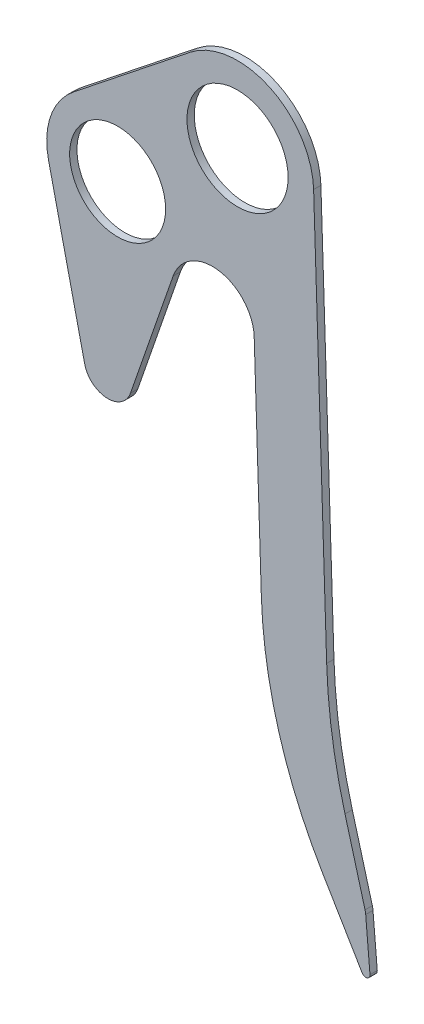
ISO-10303-21;
HEADER;
FILE_DESCRIPTION(('STEP AP214'),'2;1');
FILE_NAME('part.step','',(''),(''),'','','');
FILE_SCHEMA(('AUTOMOTIVE_DESIGN { 1 0 10303 214 1 1 1 1 }'));
ENDSEC;
DATA;
#1=APPLICATION_CONTEXT('core data for automotive mechanical design processes');
#2=APPLICATION_PROTOCOL_DEFINITION('international standard','automotive_design',2000,#1);
#3=PRODUCT_CONTEXT('',#1,'mechanical');
#4=PRODUCT('Part','Part','',(#3));
#5=PRODUCT_RELATED_PRODUCT_CATEGORY('part','',(#4));
#6=PRODUCT_DEFINITION_FORMATION('','',#4);
#7=PRODUCT_DEFINITION_CONTEXT('part definition',#1,'design');
#8=PRODUCT_DEFINITION('design','',#6,#7);
#9=PRODUCT_DEFINITION_SHAPE('','',#8);
#10=(LENGTH_UNIT() NAMED_UNIT(*) SI_UNIT(.MILLI.,.METRE.));
#11=(NAMED_UNIT(*) PLANE_ANGLE_UNIT() SI_UNIT($,.RADIAN.));
#12=(NAMED_UNIT(*) SI_UNIT($,.STERADIAN.) SOLID_ANGLE_UNIT());
#13=UNCERTAINTY_MEASURE_WITH_UNIT(LENGTH_MEASURE(1.E-05),#10,'distance_accuracy_value','');
#14=(GEOMETRIC_REPRESENTATION_CONTEXT(3) GLOBAL_UNCERTAINTY_ASSIGNED_CONTEXT((#13)) GLOBAL_UNIT_ASSIGNED_CONTEXT((#10,
#11,#12)) REPRESENTATION_CONTEXT('',''));
#15=CARTESIAN_POINT('',(0.,0.,0.));
#16=DIRECTION('',(0.,0.,1.));
#17=DIRECTION('',(1.,0.,0.));
#18=AXIS2_PLACEMENT_3D('',#15,#16,#17);
#19=CARTESIAN_POINT('',(-115.,-85.,7.));
#20=DIRECTION('',(0.,0.,1.));
#21=DIRECTION('',(1.,0.,0.));
#22=AXIS2_PLACEMENT_3D('',#19,#20,#21);
#23=PLANE('',#22);
#24=CARTESIAN_POINT('',(0.,0.,7.));
#25=DIRECTION('',(0.,0.,1.));
#26=DIRECTION('',(1.,0.,0.));
#27=AXIS2_PLACEMENT_3D('',#24,#25,#26);
#28=CIRCLE('',#27,48.5);
#29=CARTESIAN_POINT('',(48.5,0.,7.));
#30=VERTEX_POINT('',#29);
#31=EDGE_CURVE('E188',#30,#30,#28,.T.);
#32=ORIENTED_EDGE('',*,*,#31,.F.);
#33=EDGE_LOOP('',(#32));
#34=FACE_BOUND('',#33,.T.);
#35=CARTESIAN_POINT('',(-115.,-85.,7.));
#36=DIRECTION('',(0.,0.,1.));
#37=DIRECTION('',(1.,0.,0.));
#38=AXIS2_PLACEMENT_3D('',#35,#36,#37);
#39=CIRCLE('',#38,68.);
#40=CARTESIAN_POINT('',(-157.305859297598,-31.7626609503083,7.));
#41=VERTEX_POINT('',#40);
#42=CARTESIAN_POINT('',(-181.296983892909,-100.123158621906,7.));
#43=VERTEX_POINT('',#42);
#44=EDGE_CURVE('E215',#41,#43,#39,.T.);
#45=ORIENTED_EDGE('',*,*,#44,.T.);
#46=DIRECTION('',(0.222399391498616,-0.97495564548396,0.));
#47=VECTOR('',#46,1.);
#48=CARTESIAN_POINT('',(-181.296983892909,-100.123158621906,7.));
#49=LINE('',#48,#47);
#50=CARTESIAN_POINT('',(-146.605418010177,-252.204231236977,7.));
#51=VERTEX_POINT('',#50);
#52=EDGE_CURVE('E123',#43,#51,#49,.T.);
#53=ORIENTED_EDGE('',*,*,#52,.T.);
#54=CARTESIAN_POINT('',(-124.293083076856,-247.114512812278,7.));
#55=DIRECTION('',(0.,0.,1.));
#56=DIRECTION('',(1.,0.,0.));
#57=AXIS2_PLACEMENT_3D('',#54,#55,#56);
#58=CIRCLE('',#57,22.8854871877222);
#59=CARTESIAN_POINT('',(-102.674010073079,-254.62192290343,7.));
#60=VERTEX_POINT('',#59);
#61=EDGE_CURVE('E254',#51,#60,#58,.T.);
#62=ORIENTED_EDGE('',*,*,#61,.T.);
#63=DIRECTION('',(0.328042397768122,0.94466300089849,0.));
#64=VECTOR('',#63,1.);
#65=CARTESIAN_POINT('',(-61.7865200359396,-136.878304089275,7.));
#66=LINE('',#65,#64);
#67=CARTESIAN_POINT('',(-61.7865200359396,-136.878304089275,7.));
#68=VERTEX_POINT('',#67);
#69=EDGE_CURVE('E273',#60,#68,#66,.T.);
#70=ORIENTED_EDGE('',*,*,#69,.T.);
#71=CARTESIAN_POINT('',(-24.,-150.,7.));
#72=DIRECTION('',(0.,0.,-1.));
#73=DIRECTION('',(1.,0.,0.));
#74=AXIS2_PLACEMENT_3D('',#71,#72,#73);
#75=CIRCLE('',#74,40.);
#76=CARTESIAN_POINT('',(15.979150749081,-148.708680758969,7.));
#77=VERTEX_POINT('',#76);
#78=EDGE_CURVE('E270',#68,#77,#75,.T.);
#79=ORIENTED_EDGE('',*,*,#78,.T.);
#80=DIRECTION('',(0.0322829810257712,-0.999478768727025,0.));
#81=VECTOR('',#80,1.);
#82=CARTESIAN_POINT('',(15.979150749081,-148.708680758969,7.));
#83=LINE('',#82,#81);
#84=CARTESIAN_POINT('',(22.8038216309407,-360.,7.));
#85=VERTEX_POINT('',#84);
#86=EDGE_CURVE('E272',#77,#85,#83,.T.);
#87=ORIENTED_EDGE('',*,*,#86,.T.);
#88=CARTESIAN_POINT('',(442.584904496291,-346.441147969176,7.));
#89=DIRECTION('',(0.,0.,1.));
#90=DIRECTION('',(1.,0.,0.));
#91=AXIS2_PLACEMENT_3D('',#88,#89,#90);
#92=CIRCLE('',#91,420.);
#93=CARTESIAN_POINT('',(81.4729059463614,-560.912881545598,7.));
#94=VERTEX_POINT('',#93);
#95=EDGE_CURVE('E275',#85,#94,#92,.T.);
#96=ORIENTED_EDGE('',*,*,#95,.T.);
#97=DIRECTION('',(0.510646984705767,-0.859790472737927,0.));
#98=VECTOR('',#97,1.);
#99=CARTESIAN_POINT('',(81.4729059463614,-560.912881545598,7.));
#100=LINE('',#99,#98);
#101=CARTESIAN_POINT('',(119.560838109048,-625.042587938823,7.));
#102=VERTEX_POINT('',#101);
#103=EDGE_CURVE('E281',#94,#102,#100,.T.);
#104=ORIENTED_EDGE('',*,*,#103,.T.);
#105=CARTESIAN_POINT('',(123.,-623.,7.));
#106=DIRECTION('',(0.,0.,1.));
#107=DIRECTION('',(1.,0.,0.));
#108=AXIS2_PLACEMENT_3D('',#105,#106,#107);
#109=CIRCLE('',#108,4.);
#110=CARTESIAN_POINT('',(126.985562324961,-622.660451838684,7.));
#111=VERTEX_POINT('',#110);
#112=EDGE_CURVE('E283',#102,#111,#109,.T.);
#113=ORIENTED_EDGE('',*,*,#112,.T.);
#114=DIRECTION('',(-0.0848870403290094,0.996390581240199,0.));
#115=VECTOR('',#114,1.);
#116=CARTESIAN_POINT('',(126.985562324961,-622.660451838684,7.));
#117=LINE('',#116,#115);
#118=CARTESIAN_POINT('',(122.910471508926,-574.827683832422,7.));
#119=VERTEX_POINT('',#118);
#120=EDGE_CURVE('E285',#111,#119,#117,.T.);
#121=ORIENTED_EDGE('',*,*,#120,.T.);
#122=CARTESIAN_POINT('',(102.982659884122,-576.525424639002,7.));
#123=DIRECTION('',(0.,0.,1.));
#124=DIRECTION('',(1.,0.,0.));
#125=AXIS2_PLACEMENT_3D('',#122,#123,#124);
#126=CIRCLE('',#125,19.9999999999999);
#127=CARTESIAN_POINT('',(122.269195454809,-571.231130948563,7.));
#128=VERTEX_POINT('',#127);
#129=EDGE_CURVE('E287',#119,#128,#126,.T.);
#130=ORIENTED_EDGE('',*,*,#129,.T.);
#131=DIRECTION('',(-0.264714684521961,0.964326778534351,0.));
#132=VECTOR('',#131,1.);
#133=CARTESIAN_POINT('',(122.269195454809,-571.231130948563,7.));
#134=LINE('',#133,#132);
#135=CARTESIAN_POINT('',(103.04949425203,-501.215851748095,7.));
#136=VERTEX_POINT('',#135);
#137=EDGE_CURVE('E289',#128,#136,#134,.T.);
#138=ORIENTED_EDGE('',*,*,#137,.T.);
#139=CARTESIAN_POINT('',(585.212883519205,-368.858509487114,7.));
#140=DIRECTION('',(0.,0.,-1.));
#141=DIRECTION('',(-1.,0.,0.));
#142=AXIS2_PLACEMENT_3D('',#139,#140,#141);
#143=CIRCLE('',#142,500.);
#144=CARTESIAN_POINT('',(85.4734991556925,-385.,7.));
#145=VERTEX_POINT('',#144);
#146=EDGE_CURVE('E166',#136,#145,#143,.T.);
#147=ORIENTED_EDGE('',*,*,#146,.T.);
#148=DIRECTION('',(-0.0322829810257712,0.999478768727025,0.));
#149=VECTOR('',#148,1.);
#150=CARTESIAN_POINT('',(72.9619501170728,2.3566576148813,7.));
#151=LINE('',#150,#149);
#152=CARTESIAN_POINT('',(72.9619501170728,2.3566576148813,7.));
#153=VERTEX_POINT('',#152);
#154=EDGE_CURVE('E160',#145,#153,#151,.T.);
#155=ORIENTED_EDGE('',*,*,#154,.T.);
#156=CARTESIAN_POINT('',(0.,0.,7.));
#157=DIRECTION('',(0.,0.,1.));
#158=DIRECTION('',(1.,0.,0.));
#159=AXIS2_PLACEMENT_3D('',#156,#157,#158);
#160=CIRCLE('',#159,73.);
#161=CARTESIAN_POINT('',(-45.416584245951,57.1518492739337,7.));
#162=VERTEX_POINT('',#161);
#163=EDGE_CURVE('E164',#153,#162,#160,.T.);
#164=ORIENTED_EDGE('',*,*,#163,.T.);
#165=DIRECTION('',(-0.782902044848407,-0.622144989670562,0.));
#166=VECTOR('',#165,1.);
#167=CARTESIAN_POINT('',(-45.416584245951,57.1518492739337,7.));
#168=LINE('',#167,#166);
#169=EDGE_CURVE('E56',#162,#41,#168,.T.);
#170=ORIENTED_EDGE('',*,*,#169,.T.);
#171=EDGE_LOOP('',(#45,#53,#62,#70,#79,#87,#96,#104,#113,#121,#130,#138,#147,#155,#164,#170));
#172=FACE_BOUND('',#171,.T.);
#173=CARTESIAN_POINT('',(-115.,-85.,7.));
#174=DIRECTION('',(0.,0.,1.));
#175=DIRECTION('',(1.,0.,0.));
#176=AXIS2_PLACEMENT_3D('',#173,#174,#175);
#177=CIRCLE('',#176,46.);
#178=CARTESIAN_POINT('',(-69.,-85.,7.));
#179=VERTEX_POINT('',#178);
#180=EDGE_CURVE('E332',#179,#179,#177,.T.);
#181=ORIENTED_EDGE('',*,*,#180,.F.);
#182=EDGE_LOOP('',(#181));
#183=FACE_BOUND('',#182,.T.);
#184=ADVANCED_FACE('F39',(#34,#172,#183),#23,.T.);
#185=CARTESIAN_POINT('',(-115.,-85.,0.));
#186=DIRECTION('',(0.,0.,1.));
#187=DIRECTION('',(1.,0.,0.));
#188=AXIS2_PLACEMENT_3D('',#185,#186,#187);
#189=PLANE('',#188);
#190=CARTESIAN_POINT('',(0.,0.,0.));
#191=DIRECTION('',(0.,0.,1.));
#192=DIRECTION('',(1.,0.,0.));
#193=AXIS2_PLACEMENT_3D('',#190,#191,#192);
#194=CIRCLE('',#193,48.5);
#195=CARTESIAN_POINT('',(48.5,0.,0.));
#196=VERTEX_POINT('',#195);
#197=EDGE_CURVE('E337',#196,#196,#194,.T.);
#198=ORIENTED_EDGE('',*,*,#197,.T.);
#199=EDGE_LOOP('',(#198));
#200=FACE_BOUND('',#199,.T.);
#201=CARTESIAN_POINT('',(-115.,-85.,0.));
#202=DIRECTION('',(0.,0.,1.));
#203=DIRECTION('',(1.,0.,0.));
#204=AXIS2_PLACEMENT_3D('',#201,#202,#203);
#205=CIRCLE('',#204,68.);
#206=CARTESIAN_POINT('',(-157.305859297598,-31.7626609503083,0.));
#207=VERTEX_POINT('',#206);
#208=CARTESIAN_POINT('',(-181.296983892909,-100.123158621906,0.));
#209=VERTEX_POINT('',#208);
#210=EDGE_CURVE('E184',#207,#209,#205,.T.);
#211=ORIENTED_EDGE('',*,*,#210,.F.);
#212=DIRECTION('',(-0.782902044848407,-0.622144989670562,0.));
#213=VECTOR('',#212,1.);
#214=CARTESIAN_POINT('',(-45.416584245951,57.1518492739337,0.));
#215=LINE('',#214,#213);
#216=CARTESIAN_POINT('',(-45.416584245951,57.1518492739337,0.));
#217=VERTEX_POINT('',#216);
#218=EDGE_CURVE('E115',#217,#207,#215,.T.);
#219=ORIENTED_EDGE('',*,*,#218,.F.);
#220=CARTESIAN_POINT('',(0.,0.,0.));
#221=DIRECTION('',(0.,0.,1.));
#222=DIRECTION('',(1.,0.,0.));
#223=AXIS2_PLACEMENT_3D('',#220,#221,#222);
#224=CIRCLE('',#223,73.);
#225=CARTESIAN_POINT('',(72.9619501170728,2.3566576148813,0.));
#226=VERTEX_POINT('',#225);
#227=EDGE_CURVE('E109',#226,#217,#224,.T.);
#228=ORIENTED_EDGE('',*,*,#227,.F.);
#229=DIRECTION('',(-0.0322829810257712,0.999478768727025,0.));
#230=VECTOR('',#229,1.);
#231=CARTESIAN_POINT('',(72.9619501170728,2.3566576148813,0.));
#232=LINE('',#231,#230);
#233=CARTESIAN_POINT('',(85.4734991556925,-385.,0.));
#234=VERTEX_POINT('',#233);
#235=EDGE_CURVE('E174',#234,#226,#232,.T.);
#236=ORIENTED_EDGE('',*,*,#235,.F.);
#237=CARTESIAN_POINT('',(585.212883519205,-368.858509487114,0.));
#238=DIRECTION('',(0.,0.,-1.));
#239=DIRECTION('',(-1.,0.,0.));
#240=AXIS2_PLACEMENT_3D('',#237,#238,#239);
#241=CIRCLE('',#240,500.);
#242=CARTESIAN_POINT('',(103.04949425203,-501.215851748095,0.));
#243=VERTEX_POINT('',#242);
#244=EDGE_CURVE('E210',#243,#234,#241,.T.);
#245=ORIENTED_EDGE('',*,*,#244,.F.);
#246=DIRECTION('',(-0.264714684521961,0.964326778534351,0.));
#247=VECTOR('',#246,1.);
#248=CARTESIAN_POINT('',(122.269195454809,-571.231130948563,0.));
#249=LINE('',#248,#247);
#250=CARTESIAN_POINT('',(122.269195454809,-571.231130948563,0.));
#251=VERTEX_POINT('',#250);
#252=EDGE_CURVE('E208',#251,#243,#249,.T.);
#253=ORIENTED_EDGE('',*,*,#252,.F.);
#254=CARTESIAN_POINT('',(102.982659884122,-576.525424639002,0.));
#255=DIRECTION('',(0.,0.,1.));
#256=DIRECTION('',(1.,0.,0.));
#257=AXIS2_PLACEMENT_3D('',#254,#255,#256);
#258=CIRCLE('',#257,19.9999999999999);
#259=CARTESIAN_POINT('',(122.910471508926,-574.827683832422,0.));
#260=VERTEX_POINT('',#259);
#261=EDGE_CURVE('E206',#260,#251,#258,.T.);
#262=ORIENTED_EDGE('',*,*,#261,.F.);
#263=DIRECTION('',(-0.0848870403290094,0.996390581240199,0.));
#264=VECTOR('',#263,1.);
#265=CARTESIAN_POINT('',(126.985562324961,-622.660451838684,0.));
#266=LINE('',#265,#264);
#267=CARTESIAN_POINT('',(126.985562324961,-622.660451838684,0.));
#268=VERTEX_POINT('',#267);
#269=EDGE_CURVE('E204',#268,#260,#266,.T.);
#270=ORIENTED_EDGE('',*,*,#269,.F.);
#271=CARTESIAN_POINT('',(123.,-623.,0.));
#272=DIRECTION('',(0.,0.,1.));
#273=DIRECTION('',(1.,0.,0.));
#274=AXIS2_PLACEMENT_3D('',#271,#272,#273);
#275=CIRCLE('',#274,4.);
#276=CARTESIAN_POINT('',(119.560838109048,-625.042587938823,0.));
#277=VERTEX_POINT('',#276);
#278=EDGE_CURVE('E202',#277,#268,#275,.T.);
#279=ORIENTED_EDGE('',*,*,#278,.F.);
#280=DIRECTION('',(0.510646984705767,-0.859790472737927,0.));
#281=VECTOR('',#280,1.);
#282=CARTESIAN_POINT('',(81.4729059463614,-560.912881545598,0.));
#283=LINE('',#282,#281);
#284=CARTESIAN_POINT('',(81.4729059463614,-560.912881545598,0.));
#285=VERTEX_POINT('',#284);
#286=EDGE_CURVE('E200',#285,#277,#283,.T.);
#287=ORIENTED_EDGE('',*,*,#286,.F.);
#288=CARTESIAN_POINT('',(442.584904496291,-346.441147969176,0.));
#289=DIRECTION('',(0.,0.,1.));
#290=DIRECTION('',(1.,0.,0.));
#291=AXIS2_PLACEMENT_3D('',#288,#289,#290);
#292=CIRCLE('',#291,420.);
#293=CARTESIAN_POINT('',(22.8038216309407,-360.,0.));
#294=VERTEX_POINT('',#293);
#295=EDGE_CURVE('E198',#294,#285,#292,.T.);
#296=ORIENTED_EDGE('',*,*,#295,.F.);
#297=DIRECTION('',(0.0322829810257712,-0.999478768727025,0.));
#298=VECTOR('',#297,1.);
#299=CARTESIAN_POINT('',(15.979150749081,-148.708680758969,0.));
#300=LINE('',#299,#298);
#301=CARTESIAN_POINT('',(15.979150749081,-148.708680758969,0.));
#302=VERTEX_POINT('',#301);
#303=EDGE_CURVE('E196',#302,#294,#300,.T.);
#304=ORIENTED_EDGE('',*,*,#303,.F.);
#305=CARTESIAN_POINT('',(-24.,-150.,0.));
#306=DIRECTION('',(0.,0.,-1.));
#307=DIRECTION('',(1.,0.,0.));
#308=AXIS2_PLACEMENT_3D('',#305,#306,#307);
#309=CIRCLE('',#308,40.);
#310=CARTESIAN_POINT('',(-61.7865200359396,-136.878304089275,0.));
#311=VERTEX_POINT('',#310);
#312=EDGE_CURVE('E194',#311,#302,#309,.T.);
#313=ORIENTED_EDGE('',*,*,#312,.F.);
#314=DIRECTION('',(0.328042397768122,0.94466300089849,0.));
#315=VECTOR('',#314,1.);
#316=CARTESIAN_POINT('',(-61.7865200359396,-136.878304089275,0.));
#317=LINE('',#316,#315);
#318=CARTESIAN_POINT('',(-102.674010073079,-254.62192290343,0.));
#319=VERTEX_POINT('',#318);
#320=EDGE_CURVE('E192',#319,#311,#317,.T.);
#321=ORIENTED_EDGE('',*,*,#320,.F.);
#322=CARTESIAN_POINT('',(-124.293083076856,-247.114512812278,0.));
#323=DIRECTION('',(0.,0.,1.));
#324=DIRECTION('',(1.,0.,0.));
#325=AXIS2_PLACEMENT_3D('',#322,#323,#324);
#326=CIRCLE('',#325,22.8854871877222);
#327=CARTESIAN_POINT('',(-146.605418010177,-252.204231236977,0.));
#328=VERTEX_POINT('',#327);
#329=EDGE_CURVE('E190',#328,#319,#326,.T.);
#330=ORIENTED_EDGE('',*,*,#329,.F.);
#331=DIRECTION('',(0.222399391498616,-0.97495564548396,0.));
#332=VECTOR('',#331,1.);
#333=CARTESIAN_POINT('',(-181.296983892909,-100.123158621906,0.));
#334=LINE('',#333,#332);
#335=EDGE_CURVE('E187',#209,#328,#334,.T.);
#336=ORIENTED_EDGE('',*,*,#335,.F.);
#337=EDGE_LOOP('',(#211,#219,#228,#236,#245,#253,#262,#270,#279,#287,#296,#304,#313,#321,#330,#336));
#338=FACE_BOUND('',#337,.T.);
#339=CARTESIAN_POINT('',(-115.,-85.,0.));
#340=DIRECTION('',(0.,0.,1.));
#341=DIRECTION('',(1.,0.,0.));
#342=AXIS2_PLACEMENT_3D('',#339,#340,#341);
#343=CIRCLE('',#342,46.);
#344=CARTESIAN_POINT('',(-69.,-85.,0.));
#345=VERTEX_POINT('',#344);
#346=EDGE_CURVE('E335',#345,#345,#343,.T.);
#347=ORIENTED_EDGE('',*,*,#346,.T.);
#348=EDGE_LOOP('',(#347));
#349=FACE_BOUND('',#348,.T.);
#350=ADVANCED_FACE('F258',(#200,#338,#349),#189,.F.);
#351=CARTESIAN_POINT('',(-115.,-85.,7.));
#352=DIRECTION('',(0.,0.,-1.));
#353=DIRECTION('',(-1.,0.,0.));
#354=AXIS2_PLACEMENT_3D('',#351,#352,#353);
#355=CYLINDRICAL_SURFACE('',#354,68.);
#356=ORIENTED_EDGE('',*,*,#210,.T.);
#357=DIRECTION('',(0.,0.,-1.));
#358=VECTOR('',#357,1.);
#359=CARTESIAN_POINT('',(-181.296983892909,-100.123158621906,7.));
#360=LINE('',#359,#358);
#361=EDGE_CURVE('E11',#43,#209,#360,.T.);
#362=ORIENTED_EDGE('',*,*,#361,.F.);
#363=ORIENTED_EDGE('',*,*,#44,.F.);
#364=DIRECTION('',(0.,0.,-1.));
#365=VECTOR('',#364,1.);
#366=CARTESIAN_POINT('',(-157.305859297598,-31.7626609503083,7.));
#367=LINE('',#366,#365);
#368=EDGE_CURVE('E180',#41,#207,#367,.T.);
#369=ORIENTED_EDGE('',*,*,#368,.T.);
#370=EDGE_LOOP('',(#356,#362,#363,#369));
#371=FACE_BOUND('',#370,.T.);
#372=ADVANCED_FACE('F41',(#371),#355,.T.);
#373=CARTESIAN_POINT('',(-181.296983892909,-100.123158621906,7.));
#374=DIRECTION('',(0.97495564548396,0.222399391498616,0.));
#375=DIRECTION('',(-0.222399391498616,0.97495564548396,0.));
#376=AXIS2_PLACEMENT_3D('',#373,#374,#375);
#377=PLANE('',#376);
#378=ORIENTED_EDGE('',*,*,#335,.T.);
#379=DIRECTION('',(0.,0.,-1.));
#380=VECTOR('',#379,1.);
#381=CARTESIAN_POINT('',(-146.605418010177,-252.204231236977,7.));
#382=LINE('',#381,#380);
#383=EDGE_CURVE('E48',#51,#328,#382,.T.);
#384=ORIENTED_EDGE('',*,*,#383,.F.);
#385=ORIENTED_EDGE('',*,*,#52,.F.);
#386=ORIENTED_EDGE('',*,*,#361,.T.);
#387=EDGE_LOOP('',(#378,#384,#385,#386));
#388=FACE_BOUND('',#387,.T.);
#389=ADVANCED_FACE('F442',(#388),#377,.F.);
#390=CARTESIAN_POINT('',(-124.293083076856,-247.114512812278,7.));
#391=DIRECTION('',(0.,0.,-1.));
#392=DIRECTION('',(-1.,0.,0.));
#393=AXIS2_PLACEMENT_3D('',#390,#391,#392);
#394=CYLINDRICAL_SURFACE('',#393,22.8854871877222);
#395=ORIENTED_EDGE('',*,*,#329,.T.);
#396=DIRECTION('',(0.,0.,-1.));
#397=VECTOR('',#396,1.);
#398=CARTESIAN_POINT('',(-102.674010073079,-254.62192290343,7.));
#399=LINE('',#398,#397);
#400=EDGE_CURVE('E246',#60,#319,#399,.T.);
#401=ORIENTED_EDGE('',*,*,#400,.F.);
#402=ORIENTED_EDGE('',*,*,#61,.F.);
#403=ORIENTED_EDGE('',*,*,#383,.T.);
#404=EDGE_LOOP('',(#395,#401,#402,#403));
#405=FACE_BOUND('',#404,.T.);
#406=ADVANCED_FACE('F252',(#405),#394,.T.);
#407=CARTESIAN_POINT('',(-61.7865200359396,-136.878304089275,7.));
#408=DIRECTION('',(-0.94466300089849,0.328042397768122,0.));
#409=DIRECTION('',(-0.328042397768122,-0.94466300089849,0.));
#410=AXIS2_PLACEMENT_3D('',#407,#408,#409);
#411=PLANE('',#410);
#412=ORIENTED_EDGE('',*,*,#320,.T.);
#413=DIRECTION('',(0.,0.,-1.));
#414=VECTOR('',#413,1.);
#415=CARTESIAN_POINT('',(-61.7865200359396,-136.878304089275,7.));
#416=LINE('',#415,#414);
#417=EDGE_CURVE('E243',#68,#311,#416,.T.);
#418=ORIENTED_EDGE('',*,*,#417,.F.);
#419=ORIENTED_EDGE('',*,*,#69,.F.);
#420=ORIENTED_EDGE('',*,*,#400,.T.);
#421=EDGE_LOOP('',(#412,#418,#419,#420));
#422=FACE_BOUND('',#421,.T.);
#423=ADVANCED_FACE('F264',(#422),#411,.F.);
#424=CARTESIAN_POINT('',(-24.,-150.,7.));
#425=DIRECTION('',(0.,0.,-1.));
#426=DIRECTION('',(-1.,0.,0.));
#427=AXIS2_PLACEMENT_3D('',#424,#425,#426);
#428=CYLINDRICAL_SURFACE('',#427,40.);
#429=ORIENTED_EDGE('',*,*,#312,.T.);
#430=DIRECTION('',(0.,0.,-1.));
#431=VECTOR('',#430,1.);
#432=CARTESIAN_POINT('',(15.979150749081,-148.708680758969,7.));
#433=LINE('',#432,#431);
#434=EDGE_CURVE('E240',#77,#302,#433,.T.);
#435=ORIENTED_EDGE('',*,*,#434,.F.);
#436=ORIENTED_EDGE('',*,*,#78,.F.);
#437=ORIENTED_EDGE('',*,*,#417,.T.);
#438=EDGE_LOOP('',(#429,#435,#436,#437));
#439=FACE_BOUND('',#438,.T.);
#440=ADVANCED_FACE('F268',(#439),#428,.F.);
#441=CARTESIAN_POINT('',(15.979150749081,-148.708680758969,7.));
#442=DIRECTION('',(0.999478768727025,0.0322829810257712,0.));
#443=DIRECTION('',(-0.0322829810257712,0.999478768727025,0.));
#444=AXIS2_PLACEMENT_3D('',#441,#442,#443);
#445=PLANE('',#444);
#446=ORIENTED_EDGE('',*,*,#303,.T.);
#447=DIRECTION('',(0.,0.,-1.));
#448=VECTOR('',#447,1.);
#449=CARTESIAN_POINT('',(22.8038216309407,-360.,7.));
#450=LINE('',#449,#448);
#451=EDGE_CURVE('E237',#85,#294,#450,.T.);
#452=ORIENTED_EDGE('',*,*,#451,.F.);
#453=ORIENTED_EDGE('',*,*,#86,.F.);
#454=ORIENTED_EDGE('',*,*,#434,.T.);
#455=EDGE_LOOP('',(#446,#452,#453,#454));
#456=FACE_BOUND('',#455,.T.);
#457=ADVANCED_FACE('F415',(#456),#445,.F.);
#458=CARTESIAN_POINT('',(442.584904496291,-346.441147969176,7.));
#459=DIRECTION('',(0.,0.,-1.));
#460=DIRECTION('',(-1.,0.,0.));
#461=AXIS2_PLACEMENT_3D('',#458,#459,#460);
#462=CYLINDRICAL_SURFACE('',#461,420.);
#463=ORIENTED_EDGE('',*,*,#295,.T.);
#464=DIRECTION('',(0.,0.,-1.));
#465=VECTOR('',#464,1.);
#466=CARTESIAN_POINT('',(81.4729059463614,-560.912881545598,7.));
#467=LINE('',#466,#465);
#468=EDGE_CURVE('E234',#94,#285,#467,.T.);
#469=ORIENTED_EDGE('',*,*,#468,.F.);
#470=ORIENTED_EDGE('',*,*,#95,.F.);
#471=ORIENTED_EDGE('',*,*,#451,.T.);
#472=EDGE_LOOP('',(#463,#469,#470,#471));
#473=FACE_BOUND('',#472,.T.);
#474=ADVANCED_FACE('F407',(#473),#462,.T.);
#475=CARTESIAN_POINT('',(81.4729059463614,-560.912881545598,7.));
#476=DIRECTION('',(0.859790472737927,0.510646984705766,0.));
#477=DIRECTION('',(-0.510646984705767,0.859790472737928,0.));
#478=AXIS2_PLACEMENT_3D('',#475,#476,#477);
#479=PLANE('',#478);
#480=ORIENTED_EDGE('',*,*,#286,.T.);
#481=DIRECTION('',(0.,0.,-1.));
#482=VECTOR('',#481,1.);
#483=CARTESIAN_POINT('',(119.560838109048,-625.042587938823,7.));
#484=LINE('',#483,#482);
#485=EDGE_CURVE('E231',#102,#277,#484,.T.);
#486=ORIENTED_EDGE('',*,*,#485,.F.);
#487=ORIENTED_EDGE('',*,*,#103,.F.);
#488=ORIENTED_EDGE('',*,*,#468,.T.);
#489=EDGE_LOOP('',(#480,#486,#487,#488));
#490=FACE_BOUND('',#489,.T.);
#491=ADVANCED_FACE('F399',(#490),#479,.F.);
#492=CARTESIAN_POINT('',(123.,-623.,7.));
#493=DIRECTION('',(0.,0.,-1.));
#494=DIRECTION('',(-1.,0.,0.));
#495=AXIS2_PLACEMENT_3D('',#492,#493,#494);
#496=CYLINDRICAL_SURFACE('',#495,4.);
#497=ORIENTED_EDGE('',*,*,#278,.T.);
#498=DIRECTION('',(0.,0.,-1.));
#499=VECTOR('',#498,1.);
#500=CARTESIAN_POINT('',(126.985562324961,-622.660451838684,7.));
#501=LINE('',#500,#499);
#502=EDGE_CURVE('E228',#111,#268,#501,.T.);
#503=ORIENTED_EDGE('',*,*,#502,.F.);
#504=ORIENTED_EDGE('',*,*,#112,.F.);
#505=ORIENTED_EDGE('',*,*,#485,.T.);
#506=EDGE_LOOP('',(#497,#503,#504,#505));
#507=FACE_BOUND('',#506,.T.);
#508=ADVANCED_FACE('F391',(#507),#496,.T.);
#509=CARTESIAN_POINT('',(126.985562324961,-622.660451838684,7.));
#510=DIRECTION('',(-0.996390581240199,-0.0848870403290094,0.));
#511=DIRECTION('',(0.0848870403290094,-0.996390581240199,0.));
#512=AXIS2_PLACEMENT_3D('',#509,#510,#511);
#513=PLANE('',#512);
#514=ORIENTED_EDGE('',*,*,#269,.T.);
#515=DIRECTION('',(0.,0.,-1.));
#516=VECTOR('',#515,1.);
#517=CARTESIAN_POINT('',(122.910471508926,-574.827683832422,7.));
#518=LINE('',#517,#516);
#519=EDGE_CURVE('E225',#119,#260,#518,.T.);
#520=ORIENTED_EDGE('',*,*,#519,.F.);
#521=ORIENTED_EDGE('',*,*,#120,.F.);
#522=ORIENTED_EDGE('',*,*,#502,.T.);
#523=EDGE_LOOP('',(#514,#520,#521,#522));
#524=FACE_BOUND('',#523,.T.);
#525=ADVANCED_FACE('F383',(#524),#513,.F.);
#526=CARTESIAN_POINT('',(102.982659884122,-576.525424639002,7.));
#527=DIRECTION('',(0.,0.,-1.));
#528=DIRECTION('',(-1.,0.,0.));
#529=AXIS2_PLACEMENT_3D('',#526,#527,#528);
#530=CYLINDRICAL_SURFACE('',#529,19.9999999999999);
#531=ORIENTED_EDGE('',*,*,#261,.T.);
#532=DIRECTION('',(0.,0.,-1.));
#533=VECTOR('',#532,1.);
#534=CARTESIAN_POINT('',(122.269195454809,-571.231130948563,7.));
#535=LINE('',#534,#533);
#536=EDGE_CURVE('E222',#128,#251,#535,.T.);
#537=ORIENTED_EDGE('',*,*,#536,.F.);
#538=ORIENTED_EDGE('',*,*,#129,.F.);
#539=ORIENTED_EDGE('',*,*,#519,.T.);
#540=EDGE_LOOP('',(#531,#537,#538,#539));
#541=FACE_BOUND('',#540,.T.);
#542=ADVANCED_FACE('F376',(#541),#530,.T.);
#543=CARTESIAN_POINT('',(122.269195454809,-571.231130948563,7.));
#544=DIRECTION('',(-0.964326778534351,-0.264714684521961,0.));
#545=DIRECTION('',(0.264714684521961,-0.964326778534351,0.));
#546=AXIS2_PLACEMENT_3D('',#543,#544,#545);
#547=PLANE('',#546);
#548=ORIENTED_EDGE('',*,*,#252,.T.);
#549=DIRECTION('',(0.,0.,-1.));
#550=VECTOR('',#549,1.);
#551=CARTESIAN_POINT('',(103.04949425203,-501.215851748095,7.));
#552=LINE('',#551,#550);
#553=EDGE_CURVE('E219',#136,#243,#552,.T.);
#554=ORIENTED_EDGE('',*,*,#553,.F.);
#555=ORIENTED_EDGE('',*,*,#137,.F.);
#556=ORIENTED_EDGE('',*,*,#536,.T.);
#557=EDGE_LOOP('',(#548,#554,#555,#556));
#558=FACE_BOUND('',#557,.T.);
#559=ADVANCED_FACE('F295',(#558),#547,.F.);
#560=CARTESIAN_POINT('',(585.212883519205,-368.858509487114,7.));
#561=DIRECTION('',(0.,0.,-1.));
#562=DIRECTION('',(-1.,0.,0.));
#563=AXIS2_PLACEMENT_3D('',#560,#561,#562);
#564=CYLINDRICAL_SURFACE('',#563,500.);
#565=ORIENTED_EDGE('',*,*,#244,.T.);
#566=DIRECTION('',(0.,0.,-1.));
#567=VECTOR('',#566,1.);
#568=CARTESIAN_POINT('',(85.4734991556925,-385.,7.));
#569=LINE('',#568,#567);
#570=EDGE_CURVE('E175',#145,#234,#569,.T.);
#571=ORIENTED_EDGE('',*,*,#570,.F.);
#572=ORIENTED_EDGE('',*,*,#146,.F.);
#573=ORIENTED_EDGE('',*,*,#553,.T.);
#574=EDGE_LOOP('',(#565,#571,#572,#573));
#575=FACE_BOUND('',#574,.T.);
#576=ADVANCED_FACE('F299',(#575),#564,.F.);
#577=CARTESIAN_POINT('',(72.9619501170728,2.3566576148813,7.));
#578=DIRECTION('',(-0.999478768727025,-0.0322829810257712,0.));
#579=DIRECTION('',(0.0322829810257712,-0.999478768727025,0.));
#580=AXIS2_PLACEMENT_3D('',#577,#578,#579);
#581=PLANE('',#580);
#582=ORIENTED_EDGE('',*,*,#235,.T.);
#583=DIRECTION('',(0.,0.,-1.));
#584=VECTOR('',#583,1.);
#585=CARTESIAN_POINT('',(72.9619501170728,2.3566576148813,7.));
#586=LINE('',#585,#584);
#587=EDGE_CURVE('E171',#153,#226,#586,.T.);
#588=ORIENTED_EDGE('',*,*,#587,.F.);
#589=ORIENTED_EDGE('',*,*,#154,.F.);
#590=ORIENTED_EDGE('',*,*,#570,.T.);
#591=EDGE_LOOP('',(#582,#588,#589,#590));
#592=FACE_BOUND('',#591,.T.);
#593=ADVANCED_FACE('F172',(#592),#581,.F.);
#594=CARTESIAN_POINT('',(0.,0.,7.));
#595=DIRECTION('',(0.,0.,-1.));
#596=DIRECTION('',(-1.,0.,0.));
#597=AXIS2_PLACEMENT_3D('',#594,#595,#596);
#598=CYLINDRICAL_SURFACE('',#597,73.);
#599=ORIENTED_EDGE('',*,*,#227,.T.);
#600=DIRECTION('',(0.,0.,-1.));
#601=VECTOR('',#600,1.);
#602=CARTESIAN_POINT('',(-45.416584245951,57.1518492739337,7.));
#603=LINE('',#602,#601);
#604=EDGE_CURVE('E176',#162,#217,#603,.T.);
#605=ORIENTED_EDGE('',*,*,#604,.F.);
#606=ORIENTED_EDGE('',*,*,#163,.F.);
#607=ORIENTED_EDGE('',*,*,#587,.T.);
#608=EDGE_LOOP('',(#599,#605,#606,#607));
#609=FACE_BOUND('',#608,.T.);
#610=ADVANCED_FACE('F178',(#609),#598,.T.);
#611=CARTESIAN_POINT('',(-45.416584245951,57.1518492739337,7.));
#612=DIRECTION('',(0.622144989670562,-0.782902044848407,0.));
#613=DIRECTION('',(0.782902044848407,0.622144989670562,0.));
#614=AXIS2_PLACEMENT_3D('',#611,#612,#613);
#615=PLANE('',#614);
#616=ORIENTED_EDGE('',*,*,#218,.T.);
#617=ORIENTED_EDGE('',*,*,#368,.F.);
#618=ORIENTED_EDGE('',*,*,#169,.F.);
#619=ORIENTED_EDGE('',*,*,#604,.T.);
#620=EDGE_LOOP('',(#616,#617,#618,#619));
#621=FACE_BOUND('',#620,.T.);
#622=ADVANCED_FACE('F303',(#621),#615,.F.);
#623=CARTESIAN_POINT('',(0.,0.,7.));
#624=DIRECTION('',(0.,0.,-1.));
#625=DIRECTION('',(-1.,0.,0.));
#626=AXIS2_PLACEMENT_3D('',#623,#624,#625);
#627=CYLINDRICAL_SURFACE('',#626,48.5);
#628=ORIENTED_EDGE('',*,*,#31,.T.);
#629=EDGE_LOOP('',(#628));
#630=FACE_BOUND('',#629,.T.);
#631=ORIENTED_EDGE('',*,*,#197,.F.);
#632=EDGE_LOOP('',(#631));
#633=FACE_BOUND('',#632,.T.);
#634=ADVANCED_FACE('F305',(#630,#633),#627,.F.);
#635=CARTESIAN_POINT('',(-115.,-85.,7.));
#636=DIRECTION('',(0.,0.,-1.));
#637=DIRECTION('',(-1.,0.,0.));
#638=AXIS2_PLACEMENT_3D('',#635,#636,#637);
#639=CYLINDRICAL_SURFACE('',#638,46.);
#640=ORIENTED_EDGE('',*,*,#180,.T.);
#641=EDGE_LOOP('',(#640));
#642=FACE_BOUND('',#641,.T.);
#643=ORIENTED_EDGE('',*,*,#346,.F.);
#644=EDGE_LOOP('',(#643));
#645=FACE_BOUND('',#644,.T.);
#646=ADVANCED_FACE('F311',(#642,#645),#639,.F.);
#647=CLOSED_SHELL('',(#184,#350,#372,#389,#406,#423,#440,#457,#474,#491,#508,#525,#542,#559,
#576,#593,#610,#622,#634,#646));
#648=MANIFOLD_SOLID_BREP('B2',#647);
#649=ADVANCED_BREP_SHAPE_REPRESENTATION('',(#18,#648),#14);
#650=SHAPE_DEFINITION_REPRESENTATION(#9,#649);
ENDSEC;
END-ISO-10303-21;
